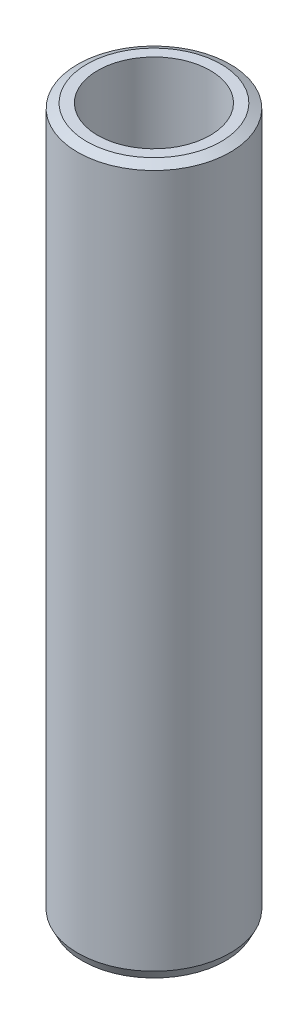
ISO-10303-21;
HEADER;
FILE_DESCRIPTION(('STEP AP214'),'2;1');
FILE_NAME('part.step','',(''),(''),'','','');
FILE_SCHEMA(('AUTOMOTIVE_DESIGN { 1 0 10303 214 1 1 1 1 }'));
ENDSEC;
DATA;
#1=APPLICATION_CONTEXT('core data for automotive mechanical design processes');
#2=APPLICATION_PROTOCOL_DEFINITION('international standard','automotive_design',2000,#1);
#3=PRODUCT_CONTEXT('',#1,'mechanical');
#4=PRODUCT('Part','Part','',(#3));
#5=PRODUCT_RELATED_PRODUCT_CATEGORY('part','',(#4));
#6=PRODUCT_DEFINITION_FORMATION('','',#4);
#7=PRODUCT_DEFINITION_CONTEXT('part definition',#1,'design');
#8=PRODUCT_DEFINITION('design','',#6,#7);
#9=PRODUCT_DEFINITION_SHAPE('','',#8);
#10=(LENGTH_UNIT() NAMED_UNIT(*) SI_UNIT(.MILLI.,.METRE.));
#11=(NAMED_UNIT(*) PLANE_ANGLE_UNIT() SI_UNIT($,.RADIAN.));
#12=(NAMED_UNIT(*) SI_UNIT($,.STERADIAN.) SOLID_ANGLE_UNIT());
#13=UNCERTAINTY_MEASURE_WITH_UNIT(LENGTH_MEASURE(1.E-05),#10,'distance_accuracy_value','');
#14=(GEOMETRIC_REPRESENTATION_CONTEXT(3) GLOBAL_UNCERTAINTY_ASSIGNED_CONTEXT((#13)) GLOBAL_UNIT_ASSIGNED_CONTEXT((#10,
#11,#12)) REPRESENTATION_CONTEXT('',''));
#15=CARTESIAN_POINT('',(0.,0.,0.));
#16=DIRECTION('',(0.,0.,1.));
#17=DIRECTION('',(1.,0.,0.));
#18=AXIS2_PLACEMENT_3D('',#15,#16,#17);
#19=CARTESIAN_POINT('',(0.,324.543361116386,0.));
#20=DIRECTION('',(0.,-1.,0.));
#21=DIRECTION('',(0.,0.,-1.));
#22=AXIS2_PLACEMENT_3D('',#19,#20,#21);
#23=CYLINDRICAL_SURFACE('',#22,35.);
#24=CARTESIAN_POINT('',(0.,322.401891018653,0.));
#25=DIRECTION('',(0.,1.,0.));
#26=DIRECTION('',(0.,0.,1.));
#27=AXIS2_PLACEMENT_3D('',#24,#25,#26);
#28=CIRCLE('',#27,35.);
#29=CARTESIAN_POINT('',(0.,322.401891018653,35.));
#30=VERTEX_POINT('',#29);
#31=EDGE_CURVE('E50',#30,#30,#28,.F.);
#32=ORIENTED_EDGE('',*,*,#31,.T.);
#33=EDGE_LOOP('',(#32));
#34=FACE_BOUND('',#33,.T.);
#35=CARTESIAN_POINT('',(0.,4.19841870772292,0.));
#36=DIRECTION('',(0.,1.,0.));
#37=DIRECTION('',(0.,0.,1.));
#38=AXIS2_PLACEMENT_3D('',#35,#36,#37);
#39=CIRCLE('',#38,35.);
#40=CARTESIAN_POINT('',(0.,4.19841870772292,35.));
#41=VERTEX_POINT('',#40);
#42=EDGE_CURVE('E51',#41,#41,#39,.T.);
#43=ORIENTED_EDGE('',*,*,#42,.T.);
#44=EDGE_LOOP('',(#43));
#45=FACE_BOUND('',#44,.T.);
#46=ADVANCED_FACE('F39',(#34,#45),#23,.T.);
#47=CARTESIAN_POINT('',(0.,324.543361116386,0.));
#48=DIRECTION('',(0.,1.,0.));
#49=DIRECTION('',(0.,0.,1.));
#50=AXIS2_PLACEMENT_3D('',#47,#48,#49);
#51=PLANE('',#50);
#52=CARTESIAN_POINT('',(0.,324.543361116386,0.));
#53=DIRECTION('',(0.,1.,0.));
#54=DIRECTION('',(0.,0.,1.));
#55=AXIS2_PLACEMENT_3D('',#52,#53,#54);
#56=CIRCLE('',#55,30.8015812922773);
#57=CARTESIAN_POINT('',(0.,324.543361116386,30.8015812922773));
#58=VERTEX_POINT('',#57);
#59=EDGE_CURVE('E54',#58,#58,#56,.T.);
#60=ORIENTED_EDGE('',*,*,#59,.T.);
#61=EDGE_LOOP('',(#60));
#62=FACE_BOUND('',#61,.T.);
#63=CARTESIAN_POINT('',(0.,324.543361116386,0.));
#64=DIRECTION('',(0.,1.,0.));
#65=DIRECTION('',(0.,0.,1.));
#66=AXIS2_PLACEMENT_3D('',#63,#64,#65);
#67=CIRCLE('',#66,25.8207139467562);
#68=CARTESIAN_POINT('',(0.,324.543361116386,25.8207139467562));
#69=VERTEX_POINT('',#68);
#70=EDGE_CURVE('E58',#69,#69,#67,.T.);
#71=ORIENTED_EDGE('',*,*,#70,.F.);
#72=EDGE_LOOP('',(#71));
#73=FACE_BOUND('',#72,.T.);
#74=ADVANCED_FACE('F69',(#62,#73),#51,.T.);
#75=CARTESIAN_POINT('',(0.,0.,0.));
#76=DIRECTION('',(0.,1.,0.));
#77=DIRECTION('',(0.,0.,1.));
#78=AXIS2_PLACEMENT_3D('',#75,#76,#77);
#79=PLANE('',#78);
#80=CARTESIAN_POINT('',(0.,0.,0.));
#81=DIRECTION('',(0.,1.,0.));
#82=DIRECTION('',(0.,0.,1.));
#83=AXIS2_PLACEMENT_3D('',#80,#81,#82);
#84=CIRCLE('',#83,32.8585299022676);
#85=CARTESIAN_POINT('',(0.,0.,32.8585299022676));
#86=VERTEX_POINT('',#85);
#87=EDGE_CURVE('E10',#86,#86,#84,.F.);
#88=ORIENTED_EDGE('',*,*,#87,.T.);
#89=EDGE_LOOP('',(#88));
#90=FACE_BOUND('',#89,.T.);
#91=CARTESIAN_POINT('',(0.,0.,0.));
#92=DIRECTION('',(0.,1.,0.));
#93=DIRECTION('',(0.,0.,1.));
#94=AXIS2_PLACEMENT_3D('',#91,#92,#93);
#95=CIRCLE('',#94,25.8207139467562);
#96=CARTESIAN_POINT('',(0.,0.,25.8207139467562));
#97=VERTEX_POINT('',#96);
#98=EDGE_CURVE('E63',#97,#97,#95,.T.);
#99=ORIENTED_EDGE('',*,*,#98,.T.);
#100=EDGE_LOOP('',(#99));
#101=FACE_BOUND('',#100,.T.);
#102=ADVANCED_FACE('F75',(#90,#101),#79,.F.);
#103=CARTESIAN_POINT('',(0.,324.543361116386,0.));
#104=DIRECTION('',(0.,-1.,0.));
#105=DIRECTION('',(0.,0.,-1.));
#106=AXIS2_PLACEMENT_3D('',#103,#104,#105);
#107=CYLINDRICAL_SURFACE('',#106,25.8207139467562);
#108=ORIENTED_EDGE('',*,*,#70,.T.);
#109=EDGE_LOOP('',(#108));
#110=FACE_BOUND('',#109,.T.);
#111=ORIENTED_EDGE('',*,*,#98,.F.);
#112=EDGE_LOOP('',(#111));
#113=FACE_BOUND('',#112,.T.);
#114=ADVANCED_FACE('F70',(#110,#113),#107,.F.);
#115=CARTESIAN_POINT('',(0.,324.543361116386,0.));
#116=DIRECTION('',(0.,-1.,0.));
#117=DIRECTION('',(0.,0.,-1.));
#118=AXIS2_PLACEMENT_3D('',#115,#116,#117);
#119=CONICAL_SURFACE('',#118,30.8015812922773,1.09912848538281);
#120=ORIENTED_EDGE('',*,*,#31,.F.);
#121=EDGE_LOOP('',(#120));
#122=FACE_BOUND('',#121,.T.);
#123=ORIENTED_EDGE('',*,*,#59,.F.);
#124=EDGE_LOOP('',(#123));
#125=FACE_BOUND('',#124,.T.);
#126=ADVANCED_FACE('F81',(#122,#125),#119,.T.);
#127=CARTESIAN_POINT('',(0.,4.19841870772292,0.));
#128=DIRECTION('',(0.,1.,0.));
#129=DIRECTION('',(0.,0.,1.));
#130=AXIS2_PLACEMENT_3D('',#127,#128,#129);
#131=CONICAL_SURFACE('',#130,35.,0.471667841412084);
#132=ORIENTED_EDGE('',*,*,#87,.F.);
#133=EDGE_LOOP('',(#132));
#134=FACE_BOUND('',#133,.T.);
#135=ORIENTED_EDGE('',*,*,#42,.F.);
#136=EDGE_LOOP('',(#135));
#137=FACE_BOUND('',#136,.T.);
#138=ADVANCED_FACE('F45',(#134,#137),#131,.T.);
#139=CLOSED_SHELL('',(#46,#74,#102,#114,#126,#138));
#140=MANIFOLD_SOLID_BREP('B2',#139);
#141=ADVANCED_BREP_SHAPE_REPRESENTATION('',(#18,#140),#14);
#142=SHAPE_DEFINITION_REPRESENTATION(#9,#141);
ENDSEC;
END-ISO-10303-21;
